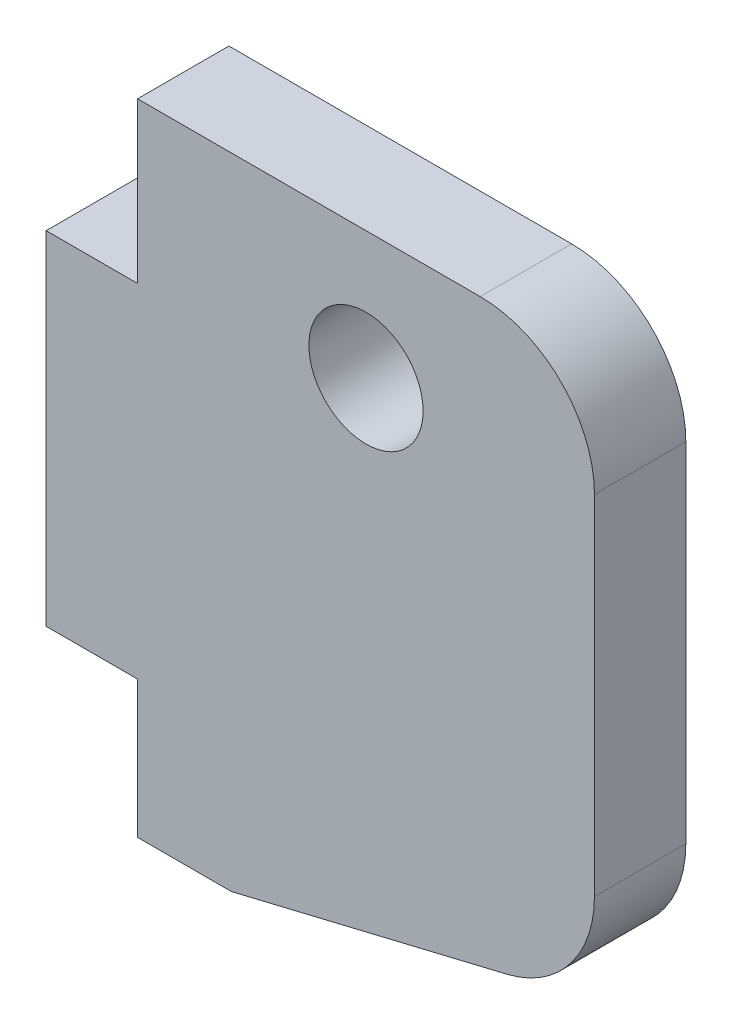
ISO-10303-21;
HEADER;
FILE_DESCRIPTION(('STEP AP214'),'2;1');
FILE_NAME('part.step','',(''),(''),'','','');
FILE_SCHEMA(('AUTOMOTIVE_DESIGN { 1 0 10303 214 1 1 1 1 }'));
ENDSEC;
DATA;
#1=APPLICATION_CONTEXT('core data for automotive mechanical design processes');
#2=APPLICATION_PROTOCOL_DEFINITION('international standard','automotive_design',2000,#1);
#3=PRODUCT_CONTEXT('',#1,'mechanical');
#4=PRODUCT('Part','Part','',(#3));
#5=PRODUCT_RELATED_PRODUCT_CATEGORY('part','',(#4));
#6=PRODUCT_DEFINITION_FORMATION('','',#4);
#7=PRODUCT_DEFINITION_CONTEXT('part definition',#1,'design');
#8=PRODUCT_DEFINITION('design','',#6,#7);
#9=PRODUCT_DEFINITION_SHAPE('','',#8);
#10=(LENGTH_UNIT() NAMED_UNIT(*) SI_UNIT(.MILLI.,.METRE.));
#11=(NAMED_UNIT(*) PLANE_ANGLE_UNIT() SI_UNIT($,.RADIAN.));
#12=(NAMED_UNIT(*) SI_UNIT($,.STERADIAN.) SOLID_ANGLE_UNIT());
#13=UNCERTAINTY_MEASURE_WITH_UNIT(LENGTH_MEASURE(1.E-05),#10,'distance_accuracy_value','');
#14=(GEOMETRIC_REPRESENTATION_CONTEXT(3) GLOBAL_UNCERTAINTY_ASSIGNED_CONTEXT((#13)) GLOBAL_UNIT_ASSIGNED_CONTEXT((#10,
#11,#12)) REPRESENTATION_CONTEXT('',''));
#15=CARTESIAN_POINT('',(0.,0.,0.));
#16=DIRECTION('',(0.,0.,1.));
#17=DIRECTION('',(1.,0.,0.));
#18=AXIS2_PLACEMENT_3D('',#15,#16,#17);
#19=CARTESIAN_POINT('',(0.,-6.,4.));
#20=DIRECTION('',(0.,-1.,0.));
#21=DIRECTION('',(1.,0.,0.));
#22=AXIS2_PLACEMENT_3D('',#19,#20,#21);
#23=PLANE('',#22);
#24=DIRECTION('',(-1.,0.,0.));
#25=VECTOR('',#24,1.);
#26=CARTESIAN_POINT('',(0.,-6.,0.));
#27=LINE('',#26,#25);
#28=CARTESIAN_POINT('',(8.11076380065098,-6.,0.));
#29=VERTEX_POINT('',#28);
#30=CARTESIAN_POINT('',(4.,-6.,0.));
#31=VERTEX_POINT('',#30);
#32=EDGE_CURVE('E130',#29,#31,#27,.T.);
#33=ORIENTED_EDGE('',*,*,#32,.F.);
#34=DIRECTION('',(0.,0.,-1.));
#35=VECTOR('',#34,1.);
#36=CARTESIAN_POINT('',(8.11076380065098,-6.,4.));
#37=LINE('',#36,#35);
#38=CARTESIAN_POINT('',(8.11076380065098,-6.,4.));
#39=VERTEX_POINT('',#38);
#40=EDGE_CURVE('E125',#39,#29,#37,.T.);
#41=ORIENTED_EDGE('',*,*,#40,.F.);
#42=DIRECTION('',(-1.,0.,0.));
#43=VECTOR('',#42,1.);
#44=CARTESIAN_POINT('',(0.,-6.,4.));
#45=LINE('',#44,#43);
#46=CARTESIAN_POINT('',(4.,-6.,4.));
#47=VERTEX_POINT('',#46);
#48=EDGE_CURVE('E127',#39,#47,#45,.T.);
#49=ORIENTED_EDGE('',*,*,#48,.T.);
#50=DIRECTION('',(0.,0.,-1.));
#51=VECTOR('',#50,1.);
#52=CARTESIAN_POINT('',(4.,-6.,4.));
#53=LINE('',#52,#51);
#54=EDGE_CURVE('E167',#47,#31,#53,.T.);
#55=ORIENTED_EDGE('',*,*,#54,.T.);
#56=EDGE_LOOP('',(#33,#41,#49,#55));
#57=FACE_BOUND('',#56,.T.);
#58=ADVANCED_FACE('F38',(#57),#23,.T.);
#59=CARTESIAN_POINT('',(1.80511260454205,-7.51468830086219,4.));
#60=DIRECTION('',(-0.233567159699266,0.972340671734973,0.));
#61=DIRECTION('',(-0.972340671734973,-0.233567159699266,0.));
#62=AXIS2_PLACEMENT_3D('',#59,#60,#61);
#63=PLANE('',#62);
#64=DIRECTION('',(0.972340671734973,0.233567159699266,0.));
#65=VECTOR('',#64,1.);
#66=CARTESIAN_POINT('',(1.80511260454205,-7.51468830086219,0.));
#67=LINE('',#66,#65);
#68=CARTESIAN_POINT('',(20.1678357984963,-3.10375576925998,0.));
#69=VERTEX_POINT('',#68);
#70=EDGE_CURVE('E172',#29,#69,#67,.T.);
#71=ORIENTED_EDGE('',*,*,#70,.T.);
#72=DIRECTION('',(0.,0.,-1.));
#73=VECTOR('',#72,1.);
#74=CARTESIAN_POINT('',(20.1678357984963,-3.10375576925998,4.));
#75=LINE('',#74,#73);
#76=CARTESIAN_POINT('',(20.1678357984963,-3.10375576925998,4.));
#77=VERTEX_POINT('',#76);
#78=EDGE_CURVE('E61',#69,#77,#75,.F.);
#79=ORIENTED_EDGE('',*,*,#78,.T.);
#80=DIRECTION('',(0.972340671734973,0.233567159699266,0.));
#81=VECTOR('',#80,1.);
#82=CARTESIAN_POINT('',(1.80511260454205,-7.51468830086219,4.));
#83=LINE('',#82,#81);
#84=EDGE_CURVE('E135',#39,#77,#83,.T.);
#85=ORIENTED_EDGE('',*,*,#84,.F.);
#86=ORIENTED_EDGE('',*,*,#40,.T.);
#87=EDGE_LOOP('',(#71,#79,#85,#86));
#88=FACE_BOUND('',#87,.T.);
#89=ADVANCED_FACE('F136',(#88),#63,.F.);
#90=CARTESIAN_POINT('',(24.,0.,4.));
#91=DIRECTION('',(1.,0.,0.));
#92=DIRECTION('',(0.,1.,0.));
#93=AXIS2_PLACEMENT_3D('',#90,#91,#92);
#94=PLANE('',#93);
#95=DIRECTION('',(0.,-1.,0.));
#96=VECTOR('',#95,1.);
#97=CARTESIAN_POINT('',(24.,0.,4.));
#98=LINE('',#97,#96);
#99=CARTESIAN_POINT('',(24.,17.,4.));
#100=VERTEX_POINT('',#99);
#101=CARTESIAN_POINT('',(24.,1.75794758941488,4.));
#102=VERTEX_POINT('',#101);
#103=EDGE_CURVE('E138',#100,#102,#98,.T.);
#104=ORIENTED_EDGE('',*,*,#103,.T.);
#105=DIRECTION('',(0.,0.,-1.));
#106=VECTOR('',#105,1.);
#107=CARTESIAN_POINT('',(24.,1.75794758941488,0.));
#108=LINE('',#107,#106);
#109=CARTESIAN_POINT('',(24.,1.75794758941488,0.));
#110=VERTEX_POINT('',#109);
#111=EDGE_CURVE('E205',#102,#110,#108,.T.);
#112=ORIENTED_EDGE('',*,*,#111,.T.);
#113=DIRECTION('',(0.,-1.,0.));
#114=VECTOR('',#113,1.);
#115=CARTESIAN_POINT('',(24.,0.,0.));
#116=LINE('',#115,#114);
#117=CARTESIAN_POINT('',(24.,17.,0.));
#118=VERTEX_POINT('',#117);
#119=EDGE_CURVE('E174',#118,#110,#116,.T.);
#120=ORIENTED_EDGE('',*,*,#119,.F.);
#121=DIRECTION('',(0.,0.,-1.));
#122=VECTOR('',#121,1.);
#123=CARTESIAN_POINT('',(24.,17.,4.));
#124=LINE('',#123,#122);
#125=EDGE_CURVE('E132',#118,#100,#124,.F.);
#126=ORIENTED_EDGE('',*,*,#125,.T.);
#127=EDGE_LOOP('',(#104,#112,#120,#126));
#128=FACE_BOUND('',#127,.T.);
#129=ADVANCED_FACE('F216',(#128),#94,.T.);
#130=CARTESIAN_POINT('',(0.,22.,4.));
#131=DIRECTION('',(0.,1.,0.));
#132=DIRECTION('',(-1.,0.,0.));
#133=AXIS2_PLACEMENT_3D('',#130,#131,#132);
#134=PLANE('',#133);
#135=DIRECTION('',(1.,0.,0.));
#136=VECTOR('',#135,1.);
#137=CARTESIAN_POINT('',(0.,22.,4.));
#138=LINE('',#137,#136);
#139=CARTESIAN_POINT('',(4.,22.,4.));
#140=VERTEX_POINT('',#139);
#141=CARTESIAN_POINT('',(19.,22.,4.));
#142=VERTEX_POINT('',#141);
#143=EDGE_CURVE('E152',#140,#142,#138,.T.);
#144=ORIENTED_EDGE('',*,*,#143,.T.);
#145=DIRECTION('',(0.,0.,-1.));
#146=VECTOR('',#145,1.);
#147=CARTESIAN_POINT('',(19.,22.,4.));
#148=LINE('',#147,#146);
#149=CARTESIAN_POINT('',(19.,22.,0.));
#150=VERTEX_POINT('',#149);
#151=EDGE_CURVE('E11',#142,#150,#148,.T.);
#152=ORIENTED_EDGE('',*,*,#151,.T.);
#153=DIRECTION('',(1.,0.,0.));
#154=VECTOR('',#153,1.);
#155=CARTESIAN_POINT('',(0.,22.,0.));
#156=LINE('',#155,#154);
#157=CARTESIAN_POINT('',(4.,22.,0.));
#158=VERTEX_POINT('',#157);
#159=EDGE_CURVE('E177',#158,#150,#156,.T.);
#160=ORIENTED_EDGE('',*,*,#159,.F.);
#161=DIRECTION('',(0.,0.,-1.));
#162=VECTOR('',#161,1.);
#163=CARTESIAN_POINT('',(4.,22.,4.));
#164=LINE('',#163,#162);
#165=EDGE_CURVE('E133',#140,#158,#164,.T.);
#166=ORIENTED_EDGE('',*,*,#165,.F.);
#167=EDGE_LOOP('',(#144,#152,#160,#166));
#168=FACE_BOUND('',#167,.T.);
#169=ADVANCED_FACE('F226',(#168),#134,.T.);
#170=CARTESIAN_POINT('',(4.,0.,4.));
#171=DIRECTION('',(-1.,0.,0.));
#172=DIRECTION('',(0.,0.,1.));
#173=AXIS2_PLACEMENT_3D('',#170,#171,#172);
#174=PLANE('',#173);
#175=DIRECTION('',(0.,1.,0.));
#176=VECTOR('',#175,1.);
#177=CARTESIAN_POINT('',(4.,0.,0.));
#178=LINE('',#177,#176);
#179=CARTESIAN_POINT('',(4.,15.,0.));
#180=VERTEX_POINT('',#179);
#181=EDGE_CURVE('E180',#180,#158,#178,.T.);
#182=ORIENTED_EDGE('',*,*,#181,.F.);
#183=DIRECTION('',(0.,0.,-1.));
#184=VECTOR('',#183,1.);
#185=CARTESIAN_POINT('',(4.,15.,4.));
#186=LINE('',#185,#184);
#187=CARTESIAN_POINT('',(4.,15.,4.));
#188=VERTEX_POINT('',#187);
#189=EDGE_CURVE('E201',#188,#180,#186,.T.);
#190=ORIENTED_EDGE('',*,*,#189,.F.);
#191=DIRECTION('',(0.,1.,0.));
#192=VECTOR('',#191,1.);
#193=CARTESIAN_POINT('',(4.,0.,4.));
#194=LINE('',#193,#192);
#195=EDGE_CURVE('E154',#188,#140,#194,.T.);
#196=ORIENTED_EDGE('',*,*,#195,.T.);
#197=ORIENTED_EDGE('',*,*,#165,.T.);
#198=EDGE_LOOP('',(#182,#190,#196,#197));
#199=FACE_BOUND('',#198,.T.);
#200=ADVANCED_FACE('F230',(#199),#174,.T.);
#201=CARTESIAN_POINT('',(0.,15.,4.));
#202=DIRECTION('',(0.,1.,0.));
#203=DIRECTION('',(0.,0.,1.));
#204=AXIS2_PLACEMENT_3D('',#201,#202,#203);
#205=PLANE('',#204);
#206=DIRECTION('',(1.,0.,0.));
#207=VECTOR('',#206,1.);
#208=CARTESIAN_POINT('',(0.,15.,0.));
#209=LINE('',#208,#207);
#210=CARTESIAN_POINT('',(0.,15.,0.));
#211=VERTEX_POINT('',#210);
#212=EDGE_CURVE('E183',#211,#180,#209,.T.);
#213=ORIENTED_EDGE('',*,*,#212,.F.);
#214=DIRECTION('',(0.,0.,-1.));
#215=VECTOR('',#214,1.);
#216=CARTESIAN_POINT('',(0.,15.,4.));
#217=LINE('',#216,#215);
#218=CARTESIAN_POINT('',(0.,15.,4.));
#219=VERTEX_POINT('',#218);
#220=EDGE_CURVE('E199',#219,#211,#217,.T.);
#221=ORIENTED_EDGE('',*,*,#220,.F.);
#222=DIRECTION('',(1.,0.,0.));
#223=VECTOR('',#222,1.);
#224=CARTESIAN_POINT('',(0.,15.,4.));
#225=LINE('',#224,#223);
#226=EDGE_CURVE('E157',#219,#188,#225,.T.);
#227=ORIENTED_EDGE('',*,*,#226,.T.);
#228=ORIENTED_EDGE('',*,*,#189,.T.);
#229=EDGE_LOOP('',(#213,#221,#227,#228));
#230=FACE_BOUND('',#229,.T.);
#231=ADVANCED_FACE('F235',(#230),#205,.T.);
#232=CARTESIAN_POINT('',(0.,0.,4.));
#233=DIRECTION('',(-1.,0.,0.));
#234=DIRECTION('',(0.,0.,1.));
#235=AXIS2_PLACEMENT_3D('',#232,#233,#234);
#236=PLANE('',#235);
#237=DIRECTION('',(0.,1.,0.));
#238=VECTOR('',#237,1.);
#239=CARTESIAN_POINT('',(0.,0.,0.));
#240=LINE('',#239,#238);
#241=CARTESIAN_POINT('',(0.,0.,0.));
#242=VERTEX_POINT('',#241);
#243=EDGE_CURVE('E186',#242,#211,#240,.T.);
#244=ORIENTED_EDGE('',*,*,#243,.F.);
#245=DIRECTION('',(0.,0.,-1.));
#246=VECTOR('',#245,1.);
#247=CARTESIAN_POINT('',(0.,0.,4.));
#248=LINE('',#247,#246);
#249=CARTESIAN_POINT('',(0.,0.,4.));
#250=VERTEX_POINT('',#249);
#251=EDGE_CURVE('E197',#250,#242,#248,.T.);
#252=ORIENTED_EDGE('',*,*,#251,.F.);
#253=DIRECTION('',(0.,1.,0.));
#254=VECTOR('',#253,1.);
#255=CARTESIAN_POINT('',(0.,0.,4.));
#256=LINE('',#255,#254);
#257=EDGE_CURVE('E160',#250,#219,#256,.T.);
#258=ORIENTED_EDGE('',*,*,#257,.T.);
#259=ORIENTED_EDGE('',*,*,#220,.T.);
#260=EDGE_LOOP('',(#244,#252,#258,#259));
#261=FACE_BOUND('',#260,.T.);
#262=ADVANCED_FACE('F238',(#261),#236,.T.);
#263=CARTESIAN_POINT('',(0.,0.,4.));
#264=DIRECTION('',(0.,-1.,0.));
#265=DIRECTION('',(1.,0.,0.));
#266=AXIS2_PLACEMENT_3D('',#263,#264,#265);
#267=PLANE('',#266);
#268=DIRECTION('',(-1.,0.,0.));
#269=VECTOR('',#268,1.);
#270=CARTESIAN_POINT('',(0.,0.,0.));
#271=LINE('',#270,#269);
#272=CARTESIAN_POINT('',(4.,0.,0.));
#273=VERTEX_POINT('',#272);
#274=EDGE_CURVE('E189',#273,#242,#271,.T.);
#275=ORIENTED_EDGE('',*,*,#274,.F.);
#276=DIRECTION('',(0.,0.,-1.));
#277=VECTOR('',#276,1.);
#278=CARTESIAN_POINT('',(4.,0.,4.));
#279=LINE('',#278,#277);
#280=CARTESIAN_POINT('',(4.,0.,4.));
#281=VERTEX_POINT('',#280);
#282=EDGE_CURVE('E195',#281,#273,#279,.T.);
#283=ORIENTED_EDGE('',*,*,#282,.F.);
#284=DIRECTION('',(-1.,0.,0.));
#285=VECTOR('',#284,1.);
#286=CARTESIAN_POINT('',(0.,0.,4.));
#287=LINE('',#286,#285);
#288=EDGE_CURVE('E163',#281,#250,#287,.T.);
#289=ORIENTED_EDGE('',*,*,#288,.T.);
#290=ORIENTED_EDGE('',*,*,#251,.T.);
#291=EDGE_LOOP('',(#275,#283,#289,#290));
#292=FACE_BOUND('',#291,.T.);
#293=ADVANCED_FACE('F241',(#292),#267,.T.);
#294=CARTESIAN_POINT('',(14.,16.41,4.));
#295=DIRECTION('',(0.,0.,-1.));
#296=DIRECTION('',(-1.,0.,0.));
#297=AXIS2_PLACEMENT_3D('',#294,#295,#296);
#298=CYLINDRICAL_SURFACE('',#297,2.5);
#299=CARTESIAN_POINT('',(14.,16.41,4.));
#300=DIRECTION('',(0.,0.,1.));
#301=DIRECTION('',(1.,0.,0.));
#302=AXIS2_PLACEMENT_3D('',#299,#300,#301);
#303=CIRCLE('',#302,2.5);
#304=CARTESIAN_POINT('',(16.5,16.41,4.));
#305=VERTEX_POINT('',#304);
#306=EDGE_CURVE('E144',#305,#305,#303,.T.);
#307=ORIENTED_EDGE('',*,*,#306,.T.);
#308=EDGE_LOOP('',(#307));
#309=FACE_BOUND('',#308,.T.);
#310=CARTESIAN_POINT('',(14.,16.41,0.));
#311=DIRECTION('',(0.,0.,1.));
#312=DIRECTION('',(1.,0.,0.));
#313=AXIS2_PLACEMENT_3D('',#310,#311,#312);
#314=CIRCLE('',#313,2.5);
#315=CARTESIAN_POINT('',(16.5,16.41,0.));
#316=VERTEX_POINT('',#315);
#317=EDGE_CURVE('E168',#316,#316,#314,.T.);
#318=ORIENTED_EDGE('',*,*,#317,.F.);
#319=EDGE_LOOP('',(#318));
#320=FACE_BOUND('',#319,.T.);
#321=ADVANCED_FACE('F246',(#309,#320),#298,.F.);
#322=CARTESIAN_POINT('',(4.,0.,4.));
#323=DIRECTION('',(-1.,0.,0.));
#324=DIRECTION('',(0.,0.,1.));
#325=AXIS2_PLACEMENT_3D('',#322,#323,#324);
#326=PLANE('',#325);
#327=DIRECTION('',(0.,1.,0.));
#328=VECTOR('',#327,1.);
#329=CARTESIAN_POINT('',(4.,0.,0.));
#330=LINE('',#329,#328);
#331=EDGE_CURVE('E147',#31,#273,#330,.T.);
#332=ORIENTED_EDGE('',*,*,#331,.F.);
#333=ORIENTED_EDGE('',*,*,#54,.F.);
#334=DIRECTION('',(0.,1.,0.));
#335=VECTOR('',#334,1.);
#336=CARTESIAN_POINT('',(4.,0.,4.));
#337=LINE('',#336,#335);
#338=EDGE_CURVE('E143',#47,#281,#337,.T.);
#339=ORIENTED_EDGE('',*,*,#338,.T.);
#340=ORIENTED_EDGE('',*,*,#282,.T.);
#341=EDGE_LOOP('',(#332,#333,#339,#340));
#342=FACE_BOUND('',#341,.T.);
#343=ADVANCED_FACE('F244',(#342),#326,.T.);
#344=CARTESIAN_POINT('',(0.,0.,4.));
#345=DIRECTION('',(0.,0.,1.));
#346=DIRECTION('',(1.,0.,0.));
#347=AXIS2_PLACEMENT_3D('',#344,#345,#346);
#348=PLANE('',#347);
#349=ORIENTED_EDGE('',*,*,#306,.F.);
#350=EDGE_LOOP('',(#349));
#351=FACE_BOUND('',#350,.T.);
#352=ORIENTED_EDGE('',*,*,#84,.T.);
#353=CARTESIAN_POINT('',(19.,1.75794758941488,4.));
#354=DIRECTION('',(0.,0.,1.));
#355=DIRECTION('',(1.,0.,0.));
#356=AXIS2_PLACEMENT_3D('',#353,#354,#355);
#357=CIRCLE('',#356,5.);
#358=EDGE_CURVE('E46',#77,#102,#357,.T.);
#359=ORIENTED_EDGE('',*,*,#358,.T.);
#360=ORIENTED_EDGE('',*,*,#103,.F.);
#361=CARTESIAN_POINT('',(19.,17.,4.));
#362=DIRECTION('',(0.,0.,1.));
#363=DIRECTION('',(1.,0.,0.));
#364=AXIS2_PLACEMENT_3D('',#361,#362,#363);
#365=CIRCLE('',#364,5.);
#366=EDGE_CURVE('E53',#100,#142,#365,.T.);
#367=ORIENTED_EDGE('',*,*,#366,.T.);
#368=ORIENTED_EDGE('',*,*,#143,.F.);
#369=ORIENTED_EDGE('',*,*,#195,.F.);
#370=ORIENTED_EDGE('',*,*,#226,.F.);
#371=ORIENTED_EDGE('',*,*,#257,.F.);
#372=ORIENTED_EDGE('',*,*,#288,.F.);
#373=ORIENTED_EDGE('',*,*,#338,.F.);
#374=ORIENTED_EDGE('',*,*,#48,.F.);
#375=EDGE_LOOP('',(#352,#359,#360,#367,#368,#369,#370,#371,#372,#373,#374));
#376=FACE_BOUND('',#375,.T.);
#377=ADVANCED_FACE('F140',(#351,#376),#348,.T.);
#378=CARTESIAN_POINT('',(0.,0.,0.));
#379=DIRECTION('',(0.,0.,1.));
#380=DIRECTION('',(1.,0.,0.));
#381=AXIS2_PLACEMENT_3D('',#378,#379,#380);
#382=PLANE('',#381);
#383=ORIENTED_EDGE('',*,*,#317,.T.);
#384=EDGE_LOOP('',(#383));
#385=FACE_BOUND('',#384,.T.);
#386=ORIENTED_EDGE('',*,*,#119,.T.);
#387=CARTESIAN_POINT('',(19.,1.75794758941488,0.));
#388=DIRECTION('',(0.,0.,1.));
#389=DIRECTION('',(1.,0.,0.));
#390=AXIS2_PLACEMENT_3D('',#387,#388,#389);
#391=CIRCLE('',#390,5.);
#392=EDGE_CURVE('E210',#110,#69,#391,.F.);
#393=ORIENTED_EDGE('',*,*,#392,.T.);
#394=ORIENTED_EDGE('',*,*,#70,.F.);
#395=ORIENTED_EDGE('',*,*,#32,.T.);
#396=ORIENTED_EDGE('',*,*,#331,.T.);
#397=ORIENTED_EDGE('',*,*,#274,.T.);
#398=ORIENTED_EDGE('',*,*,#243,.T.);
#399=ORIENTED_EDGE('',*,*,#212,.T.);
#400=ORIENTED_EDGE('',*,*,#181,.T.);
#401=ORIENTED_EDGE('',*,*,#159,.T.);
#402=CARTESIAN_POINT('',(19.,17.,0.));
#403=DIRECTION('',(0.,0.,1.));
#404=DIRECTION('',(1.,0.,0.));
#405=AXIS2_PLACEMENT_3D('',#402,#403,#404);
#406=CIRCLE('',#405,5.);
#407=EDGE_CURVE('E208',#150,#118,#406,.F.);
#408=ORIENTED_EDGE('',*,*,#407,.T.);
#409=EDGE_LOOP('',(#386,#393,#394,#395,#396,#397,#398,#399,#400,#401,#408));
#410=FACE_BOUND('',#409,.T.);
#411=ADVANCED_FACE('F221',(#385,#410),#382,.F.);
#412=CARTESIAN_POINT('',(19.,1.75794758941488,4.));
#413=DIRECTION('',(0.,0.,1.));
#414=DIRECTION('',(1.,0.,0.));
#415=AXIS2_PLACEMENT_3D('',#412,#413,#414);
#416=CYLINDRICAL_SURFACE('',#415,5.);
#417=ORIENTED_EDGE('',*,*,#358,.F.);
#418=ORIENTED_EDGE('',*,*,#78,.F.);
#419=ORIENTED_EDGE('',*,*,#392,.F.);
#420=ORIENTED_EDGE('',*,*,#111,.F.);
#421=EDGE_LOOP('',(#417,#418,#419,#420));
#422=FACE_BOUND('',#421,.T.);
#423=ADVANCED_FACE('F219',(#422),#416,.T.);
#424=CARTESIAN_POINT('',(19.,17.,4.));
#425=DIRECTION('',(0.,0.,-1.));
#426=DIRECTION('',(-1.,0.,0.));
#427=AXIS2_PLACEMENT_3D('',#424,#425,#426);
#428=CYLINDRICAL_SURFACE('',#427,5.);
#429=ORIENTED_EDGE('',*,*,#366,.F.);
#430=ORIENTED_EDGE('',*,*,#125,.F.);
#431=ORIENTED_EDGE('',*,*,#407,.F.);
#432=ORIENTED_EDGE('',*,*,#151,.F.);
#433=EDGE_LOOP('',(#429,#430,#431,#432));
#434=FACE_BOUND('',#433,.T.);
#435=ADVANCED_FACE('F40',(#434),#428,.T.);
#436=CLOSED_SHELL('',(#58,#89,#129,#169,#200,#231,#262,#293,#321,#343,#377,#411,#423,#435));
#437=MANIFOLD_SOLID_BREP('B2',#436);
#438=ADVANCED_BREP_SHAPE_REPRESENTATION('',(#18,#437),#14);
#439=SHAPE_DEFINITION_REPRESENTATION(#9,#438);
ENDSEC;
END-ISO-10303-21;
